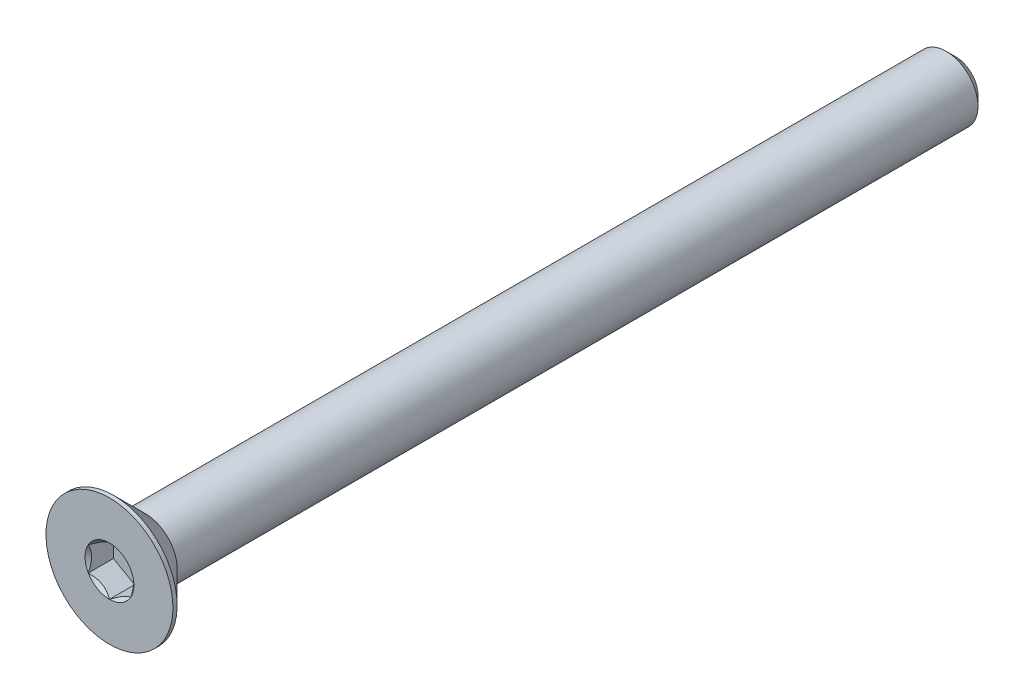
ISO-10303-21;
HEADER;
FILE_DESCRIPTION(('STEP AP214'),'2;1');
FILE_NAME('part.step','',(''),(''),'','','');
FILE_SCHEMA(('AUTOMOTIVE_DESIGN { 1 0 10303 214 1 1 1 1 }'));
ENDSEC;
DATA;
#1=APPLICATION_CONTEXT('core data for automotive mechanical design processes');
#2=APPLICATION_PROTOCOL_DEFINITION('international standard','automotive_design',2000,#1);
#3=PRODUCT_CONTEXT('',#1,'mechanical');
#4=PRODUCT('Part','Part','',(#3));
#5=PRODUCT_RELATED_PRODUCT_CATEGORY('part','',(#4));
#6=PRODUCT_DEFINITION_FORMATION('','',#4);
#7=PRODUCT_DEFINITION_CONTEXT('part definition',#1,'design');
#8=PRODUCT_DEFINITION('design','',#6,#7);
#9=PRODUCT_DEFINITION_SHAPE('','',#8);
#10=(LENGTH_UNIT() NAMED_UNIT(*) SI_UNIT(.MILLI.,.METRE.));
#11=(NAMED_UNIT(*) PLANE_ANGLE_UNIT() SI_UNIT($,.RADIAN.));
#12=(NAMED_UNIT(*) SI_UNIT($,.STERADIAN.) SOLID_ANGLE_UNIT());
#13=UNCERTAINTY_MEASURE_WITH_UNIT(LENGTH_MEASURE(1.E-05),#10,'distance_accuracy_value','');
#14=(GEOMETRIC_REPRESENTATION_CONTEXT(3) GLOBAL_UNCERTAINTY_ASSIGNED_CONTEXT((#13)) GLOBAL_UNIT_ASSIGNED_CONTEXT((#10,
#11,#12)) REPRESENTATION_CONTEXT('',''));
#15=CARTESIAN_POINT('',(0.,0.,0.));
#16=DIRECTION('',(0.,0.,1.));
#17=DIRECTION('',(1.,0.,0.));
#18=AXIS2_PLACEMENT_3D('',#15,#16,#17);
#19=CARTESIAN_POINT('',(0.,0.,-20.));
#20=DIRECTION('',(0.,0.,-1.));
#21=DIRECTION('',(0.,1.,0.));
#22=AXIS2_PLACEMENT_3D('',#19,#20,#21);
#23=CYLINDRICAL_SURFACE('',#22,1.5);
#24=CARTESIAN_POINT('',(0.,0.,18.3));
#25=DIRECTION('',(0.,0.,-1.));
#26=DIRECTION('',(0.,1.,0.));
#27=AXIS2_PLACEMENT_3D('',#24,#25,#26);
#28=CIRCLE('',#27,1.5);
#29=CARTESIAN_POINT('',(0.,1.49999999999999,18.3));
#30=VERTEX_POINT('',#29);
#31=EDGE_CURVE('E11',#30,#30,#28,.F.);
#32=ORIENTED_EDGE('',*,*,#31,.F.);
#33=EDGE_LOOP('',(#32));
#34=FACE_BOUND('',#33,.T.);
#35=CARTESIAN_POINT('',(0.,0.,-19.55));
#36=DIRECTION('',(0.,0.,-1.));
#37=DIRECTION('',(0.,1.,0.));
#38=AXIS2_PLACEMENT_3D('',#35,#36,#37);
#39=CIRCLE('',#38,1.5);
#40=CARTESIAN_POINT('',(0.,1.5,-19.55));
#41=VERTEX_POINT('',#40);
#42=EDGE_CURVE('E49',#41,#41,#39,.F.);
#43=ORIENTED_EDGE('',*,*,#42,.T.);
#44=EDGE_LOOP('',(#43));
#45=FACE_BOUND('',#44,.T.);
#46=ADVANCED_FACE('F41',(#34,#45),#23,.T.);
#47=CARTESIAN_POINT('',(0.,1.5,-20.));
#48=DIRECTION('',(0.,0.,-1.));
#49=DIRECTION('',(0.,1.,0.));
#50=AXIS2_PLACEMENT_3D('',#47,#48,#49);
#51=PLANE('',#50);
#52=CARTESIAN_POINT('',(0.,0.,-20.));
#53=DIRECTION('',(0.,0.,-1.));
#54=DIRECTION('',(0.,1.,0.));
#55=AXIS2_PLACEMENT_3D('',#52,#53,#54);
#56=CIRCLE('',#55,1.04999999999999);
#57=CARTESIAN_POINT('',(0.,1.04999999999999,-20.));
#58=VERTEX_POINT('',#57);
#59=EDGE_CURVE('E153',#58,#58,#56,.T.);
#60=ORIENTED_EDGE('',*,*,#59,.T.);
#61=EDGE_LOOP('',(#60));
#62=FACE_BOUND('',#61,.T.);
#63=ADVANCED_FACE('F162',(#62),#51,.T.);
#64=CARTESIAN_POINT('',(0.,0.,-20.));
#65=DIRECTION('',(0.,0.,1.));
#66=DIRECTION('',(0.,-1.,0.));
#67=AXIS2_PLACEMENT_3D('',#64,#65,#66);
#68=CONICAL_SURFACE('',#67,1.04999999999999,0.785398163397452);
#69=ORIENTED_EDGE('',*,*,#42,.F.);
#70=EDGE_LOOP('',(#69));
#71=FACE_BOUND('',#70,.T.);
#72=ORIENTED_EDGE('',*,*,#59,.F.);
#73=EDGE_LOOP('',(#72));
#74=FACE_BOUND('',#73,.T.);
#75=ADVANCED_FACE('F43',(#71,#74),#68,.T.);
#76=CARTESIAN_POINT('',(0.,0.,-20.));
#77=DIRECTION('',(0.,0.,-1.));
#78=DIRECTION('',(0.,1.,0.));
#79=AXIS2_PLACEMENT_3D('',#76,#77,#78);
#80=CYLINDRICAL_SURFACE('',#79,3.);
#81=CARTESIAN_POINT('',(0.,0.,20.));
#82=DIRECTION('',(0.,0.,-1.));
#83=DIRECTION('',(0.,1.,0.));
#84=AXIS2_PLACEMENT_3D('',#81,#82,#83);
#85=CIRCLE('',#84,3.);
#86=CARTESIAN_POINT('',(0.,3.,20.));
#87=VERTEX_POINT('',#86);
#88=EDGE_CURVE('E133',#87,#87,#85,.T.);
#89=ORIENTED_EDGE('',*,*,#88,.T.);
#90=EDGE_LOOP('',(#89));
#91=FACE_BOUND('',#90,.T.);
#92=CARTESIAN_POINT('',(0.,0.,19.8));
#93=DIRECTION('',(0.,0.,-1.));
#94=DIRECTION('',(0.,1.,0.));
#95=AXIS2_PLACEMENT_3D('',#92,#93,#94);
#96=CIRCLE('',#95,3.);
#97=CARTESIAN_POINT('',(0.,3.,19.8));
#98=VERTEX_POINT('',#97);
#99=EDGE_CURVE('E130',#98,#98,#96,.T.);
#100=ORIENTED_EDGE('',*,*,#99,.F.);
#101=EDGE_LOOP('',(#100));
#102=FACE_BOUND('',#101,.T.);
#103=ADVANCED_FACE('F161',(#91,#102),#80,.T.);
#104=CARTESIAN_POINT('',(0.,0.,18.3));
#105=DIRECTION('',(0.,0.,1.));
#106=DIRECTION('',(0.,-1.,0.));
#107=AXIS2_PLACEMENT_3D('',#104,#105,#106);
#108=CONICAL_SURFACE('',#107,1.5,0.785398163397447);
#109=ORIENTED_EDGE('',*,*,#99,.T.);
#110=EDGE_LOOP('',(#109));
#111=FACE_BOUND('',#110,.T.);
#112=ORIENTED_EDGE('',*,*,#31,.T.);
#113=EDGE_LOOP('',(#112));
#114=FACE_BOUND('',#113,.T.);
#115=ADVANCED_FACE('F175',(#111,#114),#108,.T.);
#116=CARTESIAN_POINT('',(0.,0.,20.));
#117=DIRECTION('',(0.,0.,1.));
#118=DIRECTION('',(0.,-1.,0.));
#119=AXIS2_PLACEMENT_3D('',#116,#117,#118);
#120=PLANE('',#119);
#121=CARTESIAN_POINT('',(0.,0.,20.));
#122=DIRECTION('',(0.,0.,1.));
#123=DIRECTION('',(1.,0.,0.));
#124=AXIS2_PLACEMENT_3D('',#121,#122,#123);
#125=CIRCLE('',#124,1.15470053837925);
#126=CARTESIAN_POINT('',(1.,0.577350269189628,20.));
#127=VERTEX_POINT('',#126);
#128=CARTESIAN_POINT('',(0.,1.15470053837926,20.));
#129=VERTEX_POINT('',#128);
#130=EDGE_CURVE('E100',#127,#129,#125,.T.);
#131=ORIENTED_EDGE('',*,*,#130,.F.);
#132=CARTESIAN_POINT('',(0.,0.,20.));
#133=DIRECTION('',(0.,0.,1.));
#134=DIRECTION('',(1.,0.,0.));
#135=AXIS2_PLACEMENT_3D('',#132,#133,#134);
#136=CIRCLE('',#135,1.15470053837925);
#137=CARTESIAN_POINT('',(0.999999999999989,-0.577350269189633,20.));
#138=VERTEX_POINT('',#137);
#139=EDGE_CURVE('E112',#138,#127,#136,.T.);
#140=ORIENTED_EDGE('',*,*,#139,.F.);
#141=CARTESIAN_POINT('',(0.,0.,20.));
#142=DIRECTION('',(0.,0.,1.));
#143=DIRECTION('',(1.,0.,0.));
#144=AXIS2_PLACEMENT_3D('',#141,#142,#143);
#145=CIRCLE('',#144,1.15470053837925);
#146=CARTESIAN_POINT('',(0.,-1.15470053837924,20.));
#147=VERTEX_POINT('',#146);
#148=EDGE_CURVE('E246',#147,#138,#145,.T.);
#149=ORIENTED_EDGE('',*,*,#148,.F.);
#150=CARTESIAN_POINT('',(0.,0.,20.));
#151=DIRECTION('',(0.,0.,1.));
#152=DIRECTION('',(1.,0.,0.));
#153=AXIS2_PLACEMENT_3D('',#150,#151,#152);
#154=CIRCLE('',#153,1.15470053837925);
#155=CARTESIAN_POINT('',(-1.,-0.577350269189614,20.));
#156=VERTEX_POINT('',#155);
#157=EDGE_CURVE('E125',#156,#147,#154,.T.);
#158=ORIENTED_EDGE('',*,*,#157,.F.);
#159=CARTESIAN_POINT('',(0.,0.,20.));
#160=DIRECTION('',(0.,0.,1.));
#161=DIRECTION('',(1.,0.,0.));
#162=AXIS2_PLACEMENT_3D('',#159,#160,#161);
#163=CIRCLE('',#162,1.15470053837925);
#164=CARTESIAN_POINT('',(-1.,0.577350269189625,20.));
#165=VERTEX_POINT('',#164);
#166=EDGE_CURVE('E247',#165,#156,#163,.T.);
#167=ORIENTED_EDGE('',*,*,#166,.F.);
#168=CARTESIAN_POINT('',(0.,0.,20.));
#169=DIRECTION('',(0.,0.,1.));
#170=DIRECTION('',(1.,0.,0.));
#171=AXIS2_PLACEMENT_3D('',#168,#169,#170);
#172=CIRCLE('',#171,1.15470053837925);
#173=EDGE_CURVE('E115',#129,#165,#172,.T.);
#174=ORIENTED_EDGE('',*,*,#173,.F.);
#175=EDGE_LOOP('',(#131,#140,#149,#158,#167,#174));
#176=FACE_BOUND('',#175,.T.);
#177=ORIENTED_EDGE('',*,*,#88,.F.);
#178=EDGE_LOOP('',(#177));
#179=FACE_BOUND('',#178,.T.);
#180=ADVANCED_FACE('F109',(#176,#179),#120,.T.);
#181=CARTESIAN_POINT('',(1.,0.577350269189626,18.81));
#182=DIRECTION('',(0.5,0.866025403784438,0.));
#183=DIRECTION('',(-0.866025403784439,0.5,0.));
#184=AXIS2_PLACEMENT_3D('',#181,#182,#183);
#185=PLANE('',#184);
#186=DIRECTION('',(0.,0.,1.));
#187=VECTOR('',#186,1.);
#188=CARTESIAN_POINT('',(1.,0.577350269189626,18.81));
#189=LINE('',#188,#187);
#190=CARTESIAN_POINT('',(1.,0.577350269189626,18.81));
#191=VERTEX_POINT('',#190);
#192=EDGE_CURVE('E56',#191,#127,#189,.T.);
#193=ORIENTED_EDGE('',*,*,#192,.T.);
#194=CARTESIAN_POINT('',(-0.000199999999999633,1.15481600843309,20.0001154873726));
#195=CARTESIAN_POINT('',(0.034182595007181,1.13496520795026,19.9802779308257));
#196=CARTESIAN_POINT('',(0.0691401181398249,1.11478247255942,19.9616050206389));
#197=CARTESIAN_POINT('',(0.140422802956089,1.07362739529219,19.9274147427232));
#198=CARTESIAN_POINT('',(0.176754750528984,1.0526511355808,19.9119164090235));
#199=CARTESIAN_POINT('',(0.250016613803311,1.01035337909803,19.8853673071423));
#200=CARTESIAN_POINT('',(0.286927851445414,0.989042666109241,19.8742497739969));
#201=CARTESIAN_POINT('',(0.361562729310859,0.945952199282692,19.8571198657762));
#202=CARTESIAN_POINT('',(0.399284088108636,0.924173762626597,19.8510946974667));
#203=CARTESIAN_POINT('',(0.464292198417933,0.886641312640015,19.8456605549675));
#204=CARTESIAN_POINT('',(0.491494371528172,0.870936130672276,19.8448569383167));
#205=CARTESIAN_POINT('',(0.545846040669112,0.839556179862849,19.8462066994169));
#206=CARTESIAN_POINT('',(0.572995523754875,0.823881418494924,19.8483607295472));
#207=CARTESIAN_POINT('',(0.654056277326959,0.777080970599368,19.8591169721285));
#208=CARTESIAN_POINT('',(0.707564140978426,0.746188191116431,19.8720145564154));
#209=CARTESIAN_POINT('',(0.801476065143431,0.69196811641965,19.9031407306022));
#210=CARTESIAN_POINT('',(0.842320523671835,0.668386557293372,19.9197377977018));
#211=CARTESIAN_POINT('',(0.922409637381944,0.622147085933682,19.9571249246853));
#212=CARTESIAN_POINT('',(0.961659010870437,0.599486449584576,19.9779013418174));
#213=CARTESIAN_POINT('',(1.0002,0.577234799135789,20.0001154873726));
#214=B_SPLINE_CURVE_WITH_KNOTS('',3,(#194,#195,#196,#197,#198,#199,#200,#201,#202,#203,#204,
#205,#206,#207,#208,#209,#210,#211,#212,#213),.UNSPECIFIED.,.F.,.F.,(4,2,2,2,2,2,2,2,2,4),(0.,
0.133237676828558,0.267252229834489,0.399137076269299,0.530689603280767,0.624814864263845,
0.718960890149131,0.907306626112095,1.05710100361789,1.20641411519286),.UNSPECIFIED.);
#215=EDGE_CURVE('E97',#129,#127,#214,.T.);
#216=ORIENTED_EDGE('',*,*,#215,.F.);
#217=DIRECTION('',(0.,0.,1.));
#218=VECTOR('',#217,1.);
#219=CARTESIAN_POINT('',(0.,1.15470053837925,18.81));
#220=LINE('',#219,#218);
#221=CARTESIAN_POINT('',(0.,1.15470053837925,18.81));
#222=VERTEX_POINT('',#221);
#223=EDGE_CURVE('E149',#222,#129,#220,.T.);
#224=ORIENTED_EDGE('',*,*,#223,.F.);
#225=DIRECTION('',(-0.866025403784439,0.5,0.));
#226=VECTOR('',#225,1.);
#227=CARTESIAN_POINT('',(1.,0.577350269189626,18.81));
#228=LINE('',#227,#226);
#229=EDGE_CURVE('E122',#191,#222,#228,.T.);
#230=ORIENTED_EDGE('',*,*,#229,.F.);
#231=EDGE_LOOP('',(#193,#216,#224,#230));
#232=FACE_BOUND('',#231,.T.);
#233=ADVANCED_FACE('F127',(#232),#185,.F.);
#234=CARTESIAN_POINT('',(1.,-0.577350269189627,18.81));
#235=DIRECTION('',(1.,0.,0.));
#236=DIRECTION('',(0.,0.,-1.));
#237=AXIS2_PLACEMENT_3D('',#234,#235,#236);
#238=PLANE('',#237);
#239=DIRECTION('',(0.,0.,1.));
#240=VECTOR('',#239,1.);
#241=CARTESIAN_POINT('',(1.,-0.577350269189627,18.81));
#242=LINE('',#241,#240);
#243=CARTESIAN_POINT('',(1.,-0.577350269189627,18.81));
#244=VERTEX_POINT('',#243);
#245=EDGE_CURVE('E64',#244,#138,#242,.T.);
#246=ORIENTED_EDGE('',*,*,#245,.T.);
#247=CARTESIAN_POINT('',(1.,-1.15147208646462,20.3703856775139));
#248=CARTESIAN_POINT('',(1.,-1.12343447988552,20.3492199198737));
#249=CARTESIAN_POINT('',(1.,-1.09524064850698,20.3282616921759));
#250=CARTESIAN_POINT('',(1.,-1.03847715644377,20.2868460222356));
#251=CARTESIAN_POINT('',(1.,-1.00990740382975,20.2663887061237));
#252=CARTESIAN_POINT('',(1.,-0.923120894333481,20.2056047949545));
#253=CARTESIAN_POINT('',(1.,-0.864253173759063,20.1661922289614));
#254=CARTESIAN_POINT('',(1.,-0.740809858258047,20.0888206642002));
#255=CARTESIAN_POINT('',(1.,-0.676100255137808,20.0510730391143));
#256=CARTESIAN_POINT('',(1.,-0.543448939049124,19.9820245875513));
#257=CARTESIAN_POINT('',(1.,-0.475519112027778,19.9507020278469));
#258=CARTESIAN_POINT('',(1.,-0.373555850333527,19.9123817788838));
#259=CARTESIAN_POINT('',(1.,-0.341031989670906,19.9013835916422));
#260=CARTESIAN_POINT('',(1.,-0.275199079052291,19.8819983421474));
#261=CARTESIAN_POINT('',(1.,-0.241889975173931,19.8736114597767));
#262=CARTESIAN_POINT('',(1.,-0.17524751704299,19.860025220719));
#263=CARTESIAN_POINT('',(1.,-0.141925568218173,19.854770790768));
#264=CARTESIAN_POINT('',(1.,-0.0749144362322764,19.8475486865709));
#265=CARTESIAN_POINT('',(1.,-0.041225197850159,19.8455815136105));
#266=CARTESIAN_POINT('',(1.,0.0249580992634241,19.8450831983932));
#267=CARTESIAN_POINT('',(1.,0.0574512826460425,19.8464302678886));
#268=CARTESIAN_POINT('',(1.,0.12214850570187,19.852216484499));
#269=CARTESIAN_POINT('',(1.,0.15435261013293,19.8566549206615));
#270=CARTESIAN_POINT('',(1.,0.218799898867644,19.8684568301452));
#271=CARTESIAN_POINT('',(1.,0.251033743268957,19.8758705410385));
#272=CARTESIAN_POINT('',(1.,0.314797132354923,19.8932289424987));
#273=CARTESIAN_POINT('',(1.,0.346326735731009,19.9031734212888));
#274=CARTESIAN_POINT('',(1.,0.445594187730209,19.9382234825543));
#275=CARTESIAN_POINT('',(1.,0.511919139476039,19.9673208583567));
#276=CARTESIAN_POINT('',(1.,0.641453244657535,20.0320153296865));
#277=CARTESIAN_POINT('',(1.,0.704650133126347,20.0676357767152));
#278=CARTESIAN_POINT('',(1.,0.825428490174989,20.1411239013469));
#279=CARTESIAN_POINT('',(1.,0.883132947867687,20.1787919471355));
#280=CARTESIAN_POINT('',(1.,0.968148853704567,20.2370228529432));
#281=CARTESIAN_POINT('',(1.,0.996120570380287,20.2566384757629));
#282=CARTESIAN_POINT('',(1.,1.05168177729902,20.2963885170613));
#283=CARTESIAN_POINT('',(1.,1.079271369977,20.3165227921988));
#284=CARTESIAN_POINT('',(1.,1.10670185346329,20.336872119073));
#285=B_SPLINE_CURVE_WITH_KNOTS('',3,(#247,#248,#249,#250,#251,#252,#253,#254,#255,#256,#257,
#258,#259,#260,#261,#262,#263,#264,#265,#266,#267,#268,#269,#270,#271,#272,#273,#274,#275,#276,
#277,#278,#279,#280,#281,#282,#283,#284),.UNSPECIFIED.,.F.,.F.,(4,2,2,2,2,2,2,2,2,2,2,2,2,2,2,2,
2,2,4),(0.,0.10538645908329,0.210799187330124,0.423233611565473,0.647793540908509,
0.871580877738618,0.974493074181431,1.07741235827202,1.17846428203206,1.27953161415763,
1.37694086739611,1.47432772585409,1.57343322804294,1.67253043972852,1.88917353996828,
2.10660791038814,2.31323734249844,2.41572589232045,2.51818641476504),.UNSPECIFIED.);
#286=EDGE_CURVE('E121',#127,#138,#285,.F.);
#287=ORIENTED_EDGE('',*,*,#286,.F.);
#288=ORIENTED_EDGE('',*,*,#192,.F.);
#289=DIRECTION('',(0.,1.,0.));
#290=VECTOR('',#289,1.);
#291=CARTESIAN_POINT('',(1.,-0.577350269189627,18.81));
#292=LINE('',#291,#290);
#293=EDGE_CURVE('E138',#244,#191,#292,.T.);
#294=ORIENTED_EDGE('',*,*,#293,.F.);
#295=EDGE_LOOP('',(#246,#287,#288,#294));
#296=FACE_BOUND('',#295,.T.);
#297=ADVANCED_FACE('F124',(#296),#238,.F.);
#298=CARTESIAN_POINT('',(0.,-1.15470053837925,18.81));
#299=DIRECTION('',(0.5,-0.866025403784439,0.));
#300=DIRECTION('',(0.866025403784439,0.5,0.));
#301=AXIS2_PLACEMENT_3D('',#298,#299,#300);
#302=PLANE('',#301);
#303=DIRECTION('',(0.,0.,1.));
#304=VECTOR('',#303,1.);
#305=CARTESIAN_POINT('',(0.,-1.15470053837925,18.81));
#306=LINE('',#305,#304);
#307=CARTESIAN_POINT('',(0.,-1.15470053837925,18.81));
#308=VERTEX_POINT('',#307);
#309=EDGE_CURVE('E135',#308,#147,#306,.T.);
#310=ORIENTED_EDGE('',*,*,#309,.T.);
#311=CARTESIAN_POINT('',(1.0002,-0.577234799135789,20.0001154873726));
#312=CARTESIAN_POINT('',(0.965817404992819,-0.597085599618622,19.9802779308257));
#313=CARTESIAN_POINT('',(0.930859881860175,-0.617268335009457,19.9616050206389));
#314=CARTESIAN_POINT('',(0.859577197043909,-0.658423412276687,19.9274147427232));
#315=CARTESIAN_POINT('',(0.823245249471014,-0.679399671988081,19.9119164090235));
#316=CARTESIAN_POINT('',(0.749983386196687,-0.721697428470848,19.8853673071423));
#317=CARTESIAN_POINT('',(0.713072148554584,-0.743008141459638,19.8742497739969));
#318=CARTESIAN_POINT('',(0.63843727068914,-0.786098608286187,19.8571198657762));
#319=CARTESIAN_POINT('',(0.600715911891363,-0.807877044942282,19.8510946974667));
#320=CARTESIAN_POINT('',(0.535707801582065,-0.845409494928864,19.8456605549675));
#321=CARTESIAN_POINT('',(0.508505628471826,-0.861114676896603,19.8448569383167));
#322=CARTESIAN_POINT('',(0.454153959330886,-0.89249462770603,19.8462066994169));
#323=CARTESIAN_POINT('',(0.427004476245122,-0.908169389073956,19.8483607295472));
#324=CARTESIAN_POINT('',(0.345943722673037,-0.954969836969513,19.8591169721285));
#325=CARTESIAN_POINT('',(0.29243585902157,-0.985862616452449,19.8720145564154));
#326=CARTESIAN_POINT('',(0.198523934856566,-1.04008269114923,19.9031407306022));
#327=CARTESIAN_POINT('',(0.157679476328163,-1.06366425027551,19.9197377977018));
#328=CARTESIAN_POINT('',(0.0775903626180544,-1.1099037216352,19.9571249246853));
#329=CARTESIAN_POINT('',(0.0383409891295608,-1.1325643579843,19.9779013418174));
#330=CARTESIAN_POINT('',(-0.000200000000000227,-1.15481600843309,20.0001154873726));
#331=B_SPLINE_CURVE_WITH_KNOTS('',3,(#311,#312,#313,#314,#315,#316,#317,#318,#319,#320,#321,
#322,#323,#324,#325,#326,#327,#328,#329,#330),.UNSPECIFIED.,.F.,.F.,(4,2,2,2,2,2,2,2,2,4),(0.,
0.13323767682856,0.267252229834491,0.3991370762693,0.530689603280768,0.624814864263847,
0.718960890149134,0.907306626112101,1.05710100361789,1.20641411519286),.UNSPECIFIED.);
#332=EDGE_CURVE('E244',#138,#147,#331,.T.);
#333=ORIENTED_EDGE('',*,*,#332,.F.);
#334=ORIENTED_EDGE('',*,*,#245,.F.);
#335=DIRECTION('',(0.866025403784439,0.5,0.));
#336=VECTOR('',#335,1.);
#337=CARTESIAN_POINT('',(0.,-1.15470053837925,18.81));
#338=LINE('',#337,#336);
#339=EDGE_CURVE('E236',#308,#244,#338,.T.);
#340=ORIENTED_EDGE('',*,*,#339,.F.);
#341=EDGE_LOOP('',(#310,#333,#334,#340));
#342=FACE_BOUND('',#341,.T.);
#343=ADVANCED_FACE('F201',(#342),#302,.F.);
#344=CARTESIAN_POINT('',(-1.,-0.577350269189626,18.81));
#345=DIRECTION('',(-0.5,-0.866025403784439,0.));
#346=DIRECTION('',(0.866025403784439,-0.5,0.));
#347=AXIS2_PLACEMENT_3D('',#344,#345,#346);
#348=PLANE('',#347);
#349=DIRECTION('',(0.,0.,1.));
#350=VECTOR('',#349,1.);
#351=CARTESIAN_POINT('',(-1.,-0.577350269189626,18.81));
#352=LINE('',#351,#350);
#353=CARTESIAN_POINT('',(-1.,-0.577350269189626,18.81));
#354=VERTEX_POINT('',#353);
#355=EDGE_CURVE('E143',#354,#156,#352,.T.);
#356=ORIENTED_EDGE('',*,*,#355,.T.);
#357=CARTESIAN_POINT('',(0.000199999999999887,-1.15481600843309,20.0001154873726));
#358=CARTESIAN_POINT('',(-0.0341825950071805,-1.13496520795026,19.9802779308257));
#359=CARTESIAN_POINT('',(-0.0691401181398245,-1.11478247255942,19.9616050206389));
#360=CARTESIAN_POINT('',(-0.140422802956089,-1.07362739529219,19.9274147427232));
#361=CARTESIAN_POINT('',(-0.176754750528984,-1.0526511355808,19.9119164090235));
#362=CARTESIAN_POINT('',(-0.250016613803311,-1.01035337909803,19.8853673071423));
#363=CARTESIAN_POINT('',(-0.286927851445414,-0.989042666109241,19.8742497739969));
#364=CARTESIAN_POINT('',(-0.361562729310859,-0.945952199282691,19.8571198657762));
#365=CARTESIAN_POINT('',(-0.399284088108636,-0.924173762626597,19.8510946974667));
#366=CARTESIAN_POINT('',(-0.464292198417934,-0.886641312640014,19.8456605549675));
#367=CARTESIAN_POINT('',(-0.491494371528173,-0.870936130672275,19.8448569383167));
#368=CARTESIAN_POINT('',(-0.545846040669113,-0.839556179862848,19.8462066994169));
#369=CARTESIAN_POINT('',(-0.572995523754876,-0.823881418494923,19.8483607295472));
#370=CARTESIAN_POINT('',(-0.654056277326961,-0.777080970599366,19.8591169721285));
#371=CARTESIAN_POINT('',(-0.707564140978429,-0.74618819111643,19.8720145564154));
#372=CARTESIAN_POINT('',(-0.801476065143433,-0.691968116419649,19.9031407306022));
#373=CARTESIAN_POINT('',(-0.842320523671835,-0.668386557293371,19.9197377977018));
#374=CARTESIAN_POINT('',(-0.922409637381944,-0.622147085933681,19.9571249246853));
#375=CARTESIAN_POINT('',(-0.961659010870438,-0.599486449584575,19.9779013418174));
#376=CARTESIAN_POINT('',(-1.0002,-0.577234799135788,20.0001154873726));
#377=B_SPLINE_CURVE_WITH_KNOTS('',3,(#357,#358,#359,#360,#361,#362,#363,#364,#365,#366,#367,
#368,#369,#370,#371,#372,#373,#374,#375,#376),.UNSPECIFIED.,.F.,.F.,(4,2,2,2,2,2,2,2,2,4),(0.,
0.133237676828559,0.26725222983449,0.399137076269301,0.530689603280769,0.624814864263848,
0.718960890149135,0.9073066261121,1.05710100361789,1.20641411519286),.UNSPECIFIED.);
#378=EDGE_CURVE('E218',#147,#156,#377,.T.);
#379=ORIENTED_EDGE('',*,*,#378,.F.);
#380=ORIENTED_EDGE('',*,*,#309,.F.);
#381=DIRECTION('',(0.866025403784439,-0.5,0.));
#382=VECTOR('',#381,1.);
#383=CARTESIAN_POINT('',(-1.,-0.577350269189626,18.81));
#384=LINE('',#383,#382);
#385=EDGE_CURVE('E234',#354,#308,#384,.T.);
#386=ORIENTED_EDGE('',*,*,#385,.F.);
#387=EDGE_LOOP('',(#356,#379,#380,#386));
#388=FACE_BOUND('',#387,.T.);
#389=ADVANCED_FACE('F197',(#388),#348,.F.);
#390=CARTESIAN_POINT('',(-1.,0.577350269189626,18.81));
#391=DIRECTION('',(-1.,0.,0.));
#392=DIRECTION('',(0.,-1.,0.));
#393=AXIS2_PLACEMENT_3D('',#390,#391,#392);
#394=PLANE('',#393);
#395=DIRECTION('',(0.,0.,1.));
#396=VECTOR('',#395,1.);
#397=CARTESIAN_POINT('',(-1.,0.577350269189626,18.81));
#398=LINE('',#397,#396);
#399=CARTESIAN_POINT('',(-1.,0.577350269189626,18.81));
#400=VERTEX_POINT('',#399);
#401=EDGE_CURVE('E146',#400,#165,#398,.T.);
#402=ORIENTED_EDGE('',*,*,#401,.T.);
#403=CARTESIAN_POINT('',(-1.,-1.15147208646462,20.3703856775139));
#404=CARTESIAN_POINT('',(-1.,-1.12343447988552,20.3492199198737));
#405=CARTESIAN_POINT('',(-1.,-1.09524064850698,20.3282616921759));
#406=CARTESIAN_POINT('',(-1.,-1.03847715644376,20.2868460222356));
#407=CARTESIAN_POINT('',(-1.,-1.00990740382975,20.2663887061237));
#408=CARTESIAN_POINT('',(-1.,-0.923120894333478,20.2056047949545));
#409=CARTESIAN_POINT('',(-1.,-0.864253173759061,20.1661922289614));
#410=CARTESIAN_POINT('',(-1.,-0.740809858258046,20.0888206642002));
#411=CARTESIAN_POINT('',(-1.,-0.676100255137807,20.0510730391143));
#412=CARTESIAN_POINT('',(-1.,-0.543448939049123,19.9820245875513));
#413=CARTESIAN_POINT('',(-1.,-0.475519112027777,19.9507020278469));
#414=CARTESIAN_POINT('',(-1.,-0.373555850333526,19.9123817788838));
#415=CARTESIAN_POINT('',(-1.,-0.341031989670905,19.9013835916422));
#416=CARTESIAN_POINT('',(-1.,-0.27519907905229,19.8819983421474));
#417=CARTESIAN_POINT('',(-1.,-0.24188997517393,19.8736114597767));
#418=CARTESIAN_POINT('',(-1.,-0.17524751704299,19.860025220719));
#419=CARTESIAN_POINT('',(-1.,-0.141925568218172,19.854770790768));
#420=CARTESIAN_POINT('',(-1.,-0.0749144362322764,19.8475486865709));
#421=CARTESIAN_POINT('',(-1.,-0.0412251978501591,19.8455815136105));
#422=CARTESIAN_POINT('',(-1.,0.0249580992634239,19.8450831983932));
#423=CARTESIAN_POINT('',(-1.,0.0574512826460424,19.8464302678886));
#424=CARTESIAN_POINT('',(-1.,0.12214850570187,19.852216484499));
#425=CARTESIAN_POINT('',(-1.,0.15435261013293,19.8566549206615));
#426=CARTESIAN_POINT('',(-1.,0.218799898867644,19.8684568301452));
#427=CARTESIAN_POINT('',(-1.,0.251033743268957,19.8758705410385));
#428=CARTESIAN_POINT('',(-1.,0.314797132354923,19.8932289424987));
#429=CARTESIAN_POINT('',(-1.,0.346326735731009,19.9031734212888));
#430=CARTESIAN_POINT('',(-1.,0.44559418773021,19.9382234825543));
#431=CARTESIAN_POINT('',(-1.,0.51191913947604,19.9673208583567));
#432=CARTESIAN_POINT('',(-1.,0.641453244657535,20.0320153296865));
#433=CARTESIAN_POINT('',(-1.,0.704650133126348,20.0676357767152));
#434=CARTESIAN_POINT('',(-1.,0.82542849017499,20.1411239013469));
#435=CARTESIAN_POINT('',(-1.,0.883132947867687,20.1787919471355));
#436=CARTESIAN_POINT('',(-1.,0.968148853704567,20.2370228529432));
#437=CARTESIAN_POINT('',(-1.,0.996120570380287,20.2566384757629));
#438=CARTESIAN_POINT('',(-1.,1.05168177729902,20.2963885170613));
#439=CARTESIAN_POINT('',(-1.,1.07927136997701,20.3165227921988));
#440=CARTESIAN_POINT('',(-1.,1.1067018534633,20.336872119073));
#441=B_SPLINE_CURVE_WITH_KNOTS('',3,(#403,#404,#405,#406,#407,#408,#409,#410,#411,#412,#413,
#414,#415,#416,#417,#418,#419,#420,#421,#422,#423,#424,#425,#426,#427,#428,#429,#430,#431,#432,
#433,#434,#435,#436,#437,#438,#439,#440),.UNSPECIFIED.,.F.,.F.,(4,2,2,2,2,2,2,2,2,2,2,2,2,2,2,2,
2,2,4),(0.,0.105386459083292,0.210799187330125,0.423233611565472,0.647793540908508,
0.871580877738618,0.974493074181429,1.07741235827202,1.17846428203205,1.27953161415763,
1.37694086739611,1.47432772585409,1.57343322804294,1.67253043972852,1.88917353996828,
2.10660791038814,2.31323734249844,2.41572589232045,2.51818641476504),.UNSPECIFIED.);
#442=EDGE_CURVE('E103',#156,#165,#441,.T.);
#443=ORIENTED_EDGE('',*,*,#442,.F.);
#444=ORIENTED_EDGE('',*,*,#355,.F.);
#445=DIRECTION('',(0.,-1.,0.));
#446=VECTOR('',#445,1.);
#447=CARTESIAN_POINT('',(-1.,0.577350269189626,18.81));
#448=LINE('',#447,#446);
#449=EDGE_CURVE('E231',#400,#354,#448,.T.);
#450=ORIENTED_EDGE('',*,*,#449,.F.);
#451=EDGE_LOOP('',(#402,#443,#444,#450));
#452=FACE_BOUND('',#451,.T.);
#453=ADVANCED_FACE('F193',(#452),#394,.F.);
#454=CARTESIAN_POINT('',(0.,1.15470053837925,18.81));
#455=DIRECTION('',(-0.5,0.866025403784439,0.));
#456=DIRECTION('',(-0.866025403784439,-0.5,0.));
#457=AXIS2_PLACEMENT_3D('',#454,#455,#456);
#458=PLANE('',#457);
#459=ORIENTED_EDGE('',*,*,#223,.T.);
#460=CARTESIAN_POINT('',(-1.0002,0.577234799135788,20.0001154873726));
#461=CARTESIAN_POINT('',(-0.965817404992819,0.597085599618622,19.9802779308257));
#462=CARTESIAN_POINT('',(-0.930859881860175,0.617268335009457,19.9616050206389));
#463=CARTESIAN_POINT('',(-0.859577197043911,0.658423412276686,19.9274147427232));
#464=CARTESIAN_POINT('',(-0.823245249471016,0.67939967198808,19.9119164090235));
#465=CARTESIAN_POINT('',(-0.749983386196689,0.721697428470847,19.8853673071423));
#466=CARTESIAN_POINT('',(-0.713072148554585,0.743008141459637,19.8742497739969));
#467=CARTESIAN_POINT('',(-0.63843727068914,0.786098608286187,19.8571198657762));
#468=CARTESIAN_POINT('',(-0.600715911891363,0.807877044942282,19.8510946974667));
#469=CARTESIAN_POINT('',(-0.535707801582065,0.845409494928864,19.8456605549675));
#470=CARTESIAN_POINT('',(-0.508505628471827,0.861114676896603,19.8448569383167));
#471=CARTESIAN_POINT('',(-0.454153959330887,0.89249462770603,19.8462066994169));
#472=CARTESIAN_POINT('',(-0.427004476245123,0.908169389073955,19.8483607295472));
#473=CARTESIAN_POINT('',(-0.345943722673039,0.954969836969511,19.8591169721285));
#474=CARTESIAN_POINT('',(-0.292435859021573,0.985862616452447,19.8720145564154));
#475=CARTESIAN_POINT('',(-0.198523934856569,1.04008269114923,19.9031407306022));
#476=CARTESIAN_POINT('',(-0.157679476328166,1.06366425027551,19.9197377977018));
#477=CARTESIAN_POINT('',(-0.0775903626180562,1.1099037216352,19.9571249246853));
#478=CARTESIAN_POINT('',(-0.0383409891295621,1.1325643579843,19.9779013418174));
#479=CARTESIAN_POINT('',(0.000199999999999662,1.15481600843309,20.0001154873726));
#480=B_SPLINE_CURVE_WITH_KNOTS('',3,(#460,#461,#462,#463,#464,#465,#466,#467,#468,#469,#470,
#471,#472,#473,#474,#475,#476,#477,#478,#479),.UNSPECIFIED.,.F.,.F.,(4,2,2,2,2,2,2,2,2,4),(0.,
0.133237676828559,0.267252229834491,0.399137076269301,0.53068960328077,0.624814864263848,
0.718960890149135,0.907306626112098,1.05710100361789,1.20641411519286),.UNSPECIFIED.);
#481=EDGE_CURVE('E240',#165,#129,#480,.T.);
#482=ORIENTED_EDGE('',*,*,#481,.F.);
#483=ORIENTED_EDGE('',*,*,#401,.F.);
#484=DIRECTION('',(-0.866025403784439,-0.5,0.));
#485=VECTOR('',#484,1.);
#486=CARTESIAN_POINT('',(0.,1.15470053837925,18.81));
#487=LINE('',#486,#485);
#488=EDGE_CURVE('E228',#222,#400,#487,.T.);
#489=ORIENTED_EDGE('',*,*,#488,.F.);
#490=EDGE_LOOP('',(#459,#482,#483,#489));
#491=FACE_BOUND('',#490,.T.);
#492=ADVANCED_FACE('F189',(#491),#458,.F.);
#493=CARTESIAN_POINT('',(0.,0.,18.81));
#494=DIRECTION('',(0.,0.,1.));
#495=DIRECTION('',(1.,0.,0.));
#496=AXIS2_PLACEMENT_3D('',#493,#494,#495);
#497=PLANE('',#496);
#498=ORIENTED_EDGE('',*,*,#229,.T.);
#499=ORIENTED_EDGE('',*,*,#488,.T.);
#500=ORIENTED_EDGE('',*,*,#449,.T.);
#501=ORIENTED_EDGE('',*,*,#385,.T.);
#502=ORIENTED_EDGE('',*,*,#339,.T.);
#503=ORIENTED_EDGE('',*,*,#293,.T.);
#504=EDGE_LOOP('',(#498,#499,#500,#501,#502,#503));
#505=FACE_BOUND('',#504,.T.);
#506=ADVANCED_FACE('F192',(#505),#497,.T.);
#507=CARTESIAN_POINT('',(0.,0.,20.));
#508=DIRECTION('',(0.,0.,1.));
#509=DIRECTION('',(1.,0.,0.));
#510=AXIS2_PLACEMENT_3D('',#507,#508,#509);
#511=CONICAL_SURFACE('',#510,1.15470053837925,0.78539816339745);
#512=ORIENTED_EDGE('',*,*,#481,.T.);
#513=ORIENTED_EDGE('',*,*,#173,.T.);
#514=EDGE_LOOP('',(#512,#513));
#515=FACE_BOUND('',#514,.T.);
#516=ADVANCED_FACE('F208',(#515),#511,.F.);
#517=CARTESIAN_POINT('',(0.,0.,20.));
#518=DIRECTION('',(0.,0.,1.));
#519=DIRECTION('',(1.,0.,0.));
#520=AXIS2_PLACEMENT_3D('',#517,#518,#519);
#521=CONICAL_SURFACE('',#520,1.15470053837925,0.78539816339745);
#522=ORIENTED_EDGE('',*,*,#378,.T.);
#523=ORIENTED_EDGE('',*,*,#157,.T.);
#524=EDGE_LOOP('',(#522,#523));
#525=FACE_BOUND('',#524,.T.);
#526=ADVANCED_FACE('F210',(#525),#521,.F.);
#527=CARTESIAN_POINT('',(0.,0.,20.));
#528=DIRECTION('',(0.,0.,1.));
#529=DIRECTION('',(1.,0.,0.));
#530=AXIS2_PLACEMENT_3D('',#527,#528,#529);
#531=CONICAL_SURFACE('',#530,1.15470053837925,0.78539816339745);
#532=ORIENTED_EDGE('',*,*,#286,.T.);
#533=ORIENTED_EDGE('',*,*,#139,.T.);
#534=EDGE_LOOP('',(#532,#533));
#535=FACE_BOUND('',#534,.T.);
#536=ADVANCED_FACE('F120',(#535),#531,.F.);
#537=CARTESIAN_POINT('',(0.,0.,20.));
#538=DIRECTION('',(0.,0.,1.));
#539=DIRECTION('',(1.,0.,0.));
#540=AXIS2_PLACEMENT_3D('',#537,#538,#539);
#541=CONICAL_SURFACE('',#540,1.15470053837925,0.78539816339745);
#542=ORIENTED_EDGE('',*,*,#332,.T.);
#543=ORIENTED_EDGE('',*,*,#148,.T.);
#544=EDGE_LOOP('',(#542,#543));
#545=FACE_BOUND('',#544,.T.);
#546=ADVANCED_FACE('F259',(#545),#541,.F.);
#547=CARTESIAN_POINT('',(0.,0.,20.));
#548=DIRECTION('',(0.,0.,1.));
#549=DIRECTION('',(1.,0.,0.));
#550=AXIS2_PLACEMENT_3D('',#547,#548,#549);
#551=CONICAL_SURFACE('',#550,1.15470053837925,0.78539816339745);
#552=ORIENTED_EDGE('',*,*,#442,.T.);
#553=ORIENTED_EDGE('',*,*,#166,.T.);
#554=EDGE_LOOP('',(#552,#553));
#555=FACE_BOUND('',#554,.T.);
#556=ADVANCED_FACE('F264',(#555),#551,.F.);
#557=CARTESIAN_POINT('',(0.,0.,20.));
#558=DIRECTION('',(0.,0.,1.));
#559=DIRECTION('',(1.,0.,0.));
#560=AXIS2_PLACEMENT_3D('',#557,#558,#559);
#561=CONICAL_SURFACE('',#560,1.15470053837925,0.78539816339745);
#562=ORIENTED_EDGE('',*,*,#215,.T.);
#563=ORIENTED_EDGE('',*,*,#130,.T.);
#564=EDGE_LOOP('',(#562,#563));
#565=FACE_BOUND('',#564,.T.);
#566=ADVANCED_FACE('F99',(#565),#561,.F.);
#567=CLOSED_SHELL('',(#46,#63,#75,#103,#115,#180,#233,#297,#343,#389,#453,#492,#506,#516,#526,
#536,#546,#556,#566));
#568=MANIFOLD_SOLID_BREP('B2',#567);
#569=ADVANCED_BREP_SHAPE_REPRESENTATION('',(#18,#568),#14);
#570=SHAPE_DEFINITION_REPRESENTATION(#9,#569);
ENDSEC;
END-ISO-10303-21;
